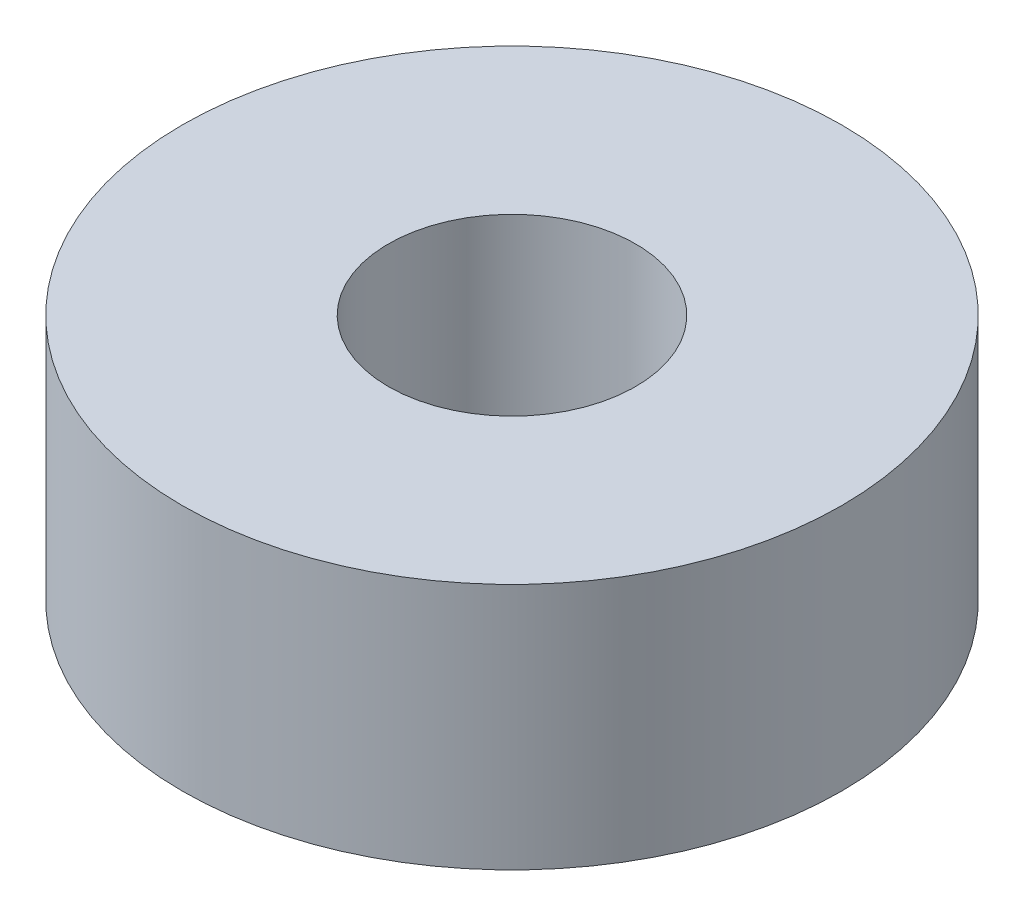
ISO-10303-21;
HEADER;
FILE_DESCRIPTION(('STEP AP214'),'2;1');
FILE_NAME('part.step','',(''),(''),'','','');
FILE_SCHEMA(('AUTOMOTIVE_DESIGN { 1 0 10303 214 1 1 1 1 }'));
ENDSEC;
DATA;
#1=APPLICATION_CONTEXT('core data for automotive mechanical design processes');
#2=APPLICATION_PROTOCOL_DEFINITION('international standard','automotive_design',2000,#1);
#3=PRODUCT_CONTEXT('',#1,'mechanical');
#4=PRODUCT('Part','Part','',(#3));
#5=PRODUCT_RELATED_PRODUCT_CATEGORY('part','',(#4));
#6=PRODUCT_DEFINITION_FORMATION('','',#4);
#7=PRODUCT_DEFINITION_CONTEXT('part definition',#1,'design');
#8=PRODUCT_DEFINITION('design','',#6,#7);
#9=PRODUCT_DEFINITION_SHAPE('','',#8);
#10=(LENGTH_UNIT() NAMED_UNIT(*) SI_UNIT(.MILLI.,.METRE.));
#11=(NAMED_UNIT(*) PLANE_ANGLE_UNIT() SI_UNIT($,.RADIAN.));
#12=(NAMED_UNIT(*) SI_UNIT($,.STERADIAN.) SOLID_ANGLE_UNIT());
#13=UNCERTAINTY_MEASURE_WITH_UNIT(LENGTH_MEASURE(1.E-05),#10,'distance_accuracy_value','');
#14=(GEOMETRIC_REPRESENTATION_CONTEXT(3) GLOBAL_UNCERTAINTY_ASSIGNED_CONTEXT((#13)) GLOBAL_UNIT_ASSIGNED_CONTEXT((#10,
#11,#12)) REPRESENTATION_CONTEXT('',''));
#15=CARTESIAN_POINT('',(0.,0.,0.));
#16=DIRECTION('',(0.,0.,1.));
#17=DIRECTION('',(1.,0.,0.));
#18=AXIS2_PLACEMENT_3D('',#15,#16,#17);
#19=CARTESIAN_POINT('',(0.,4.7625,0.));
#20=DIRECTION('',(0.,1.,0.));
#21=DIRECTION('',(0.,0.,1.));
#22=AXIS2_PLACEMENT_3D('',#19,#20,#21);
#23=PLANE('',#22);
#24=CARTESIAN_POINT('',(0.,4.7625,0.));
#25=DIRECTION('',(0.,1.,0.));
#26=DIRECTION('',(0.,0.,1.));
#27=AXIS2_PLACEMENT_3D('',#24,#25,#26);
#28=CIRCLE('',#27,12.7);
#29=CARTESIAN_POINT('',(0.,4.7625,12.7));
#30=VERTEX_POINT('',#29);
#31=EDGE_CURVE('E10',#30,#30,#28,.T.);
#32=ORIENTED_EDGE('',*,*,#31,.T.);
#33=EDGE_LOOP('',(#32));
#34=FACE_BOUND('',#33,.T.);
#35=CARTESIAN_POINT('',(0.,4.7625,0.));
#36=DIRECTION('',(0.,1.,0.));
#37=DIRECTION('',(0.,0.,1.));
#38=AXIS2_PLACEMENT_3D('',#35,#36,#37);
#39=CIRCLE('',#38,4.7625);
#40=CARTESIAN_POINT('',(0.,4.7625,4.7625));
#41=VERTEX_POINT('',#40);
#42=EDGE_CURVE('E42',#41,#41,#39,.T.);
#43=ORIENTED_EDGE('',*,*,#42,.F.);
#44=EDGE_LOOP('',(#43));
#45=FACE_BOUND('',#44,.T.);
#46=ADVANCED_FACE('F31',(#34,#45),#23,.T.);
#47=CARTESIAN_POINT('',(0.,-4.7625,0.));
#48=DIRECTION('',(0.,1.,0.));
#49=DIRECTION('',(0.,0.,1.));
#50=AXIS2_PLACEMENT_3D('',#47,#48,#49);
#51=PLANE('',#50);
#52=CARTESIAN_POINT('',(0.,-4.7625,0.));
#53=DIRECTION('',(0.,1.,0.));
#54=DIRECTION('',(0.,0.,1.));
#55=AXIS2_PLACEMENT_3D('',#52,#53,#54);
#56=CIRCLE('',#55,12.7);
#57=CARTESIAN_POINT('',(0.,-4.7625,12.7));
#58=VERTEX_POINT('',#57);
#59=EDGE_CURVE('E35',#58,#58,#56,.T.);
#60=ORIENTED_EDGE('',*,*,#59,.F.);
#61=EDGE_LOOP('',(#60));
#62=FACE_BOUND('',#61,.T.);
#63=CARTESIAN_POINT('',(0.,-4.7625,0.));
#64=DIRECTION('',(0.,1.,0.));
#65=DIRECTION('',(0.,0.,1.));
#66=AXIS2_PLACEMENT_3D('',#63,#64,#65);
#67=CIRCLE('',#66,4.7625);
#68=CARTESIAN_POINT('',(0.,-4.7625,4.7625));
#69=VERTEX_POINT('',#68);
#70=EDGE_CURVE('E44',#69,#69,#67,.T.);
#71=ORIENTED_EDGE('',*,*,#70,.T.);
#72=EDGE_LOOP('',(#71));
#73=FACE_BOUND('',#72,.T.);
#74=ADVANCED_FACE('F54',(#62,#73),#51,.F.);
#75=CARTESIAN_POINT('',(0.,4.7625,0.));
#76=DIRECTION('',(0.,-1.,0.));
#77=DIRECTION('',(0.,0.,-1.));
#78=AXIS2_PLACEMENT_3D('',#75,#76,#77);
#79=CYLINDRICAL_SURFACE('',#78,12.7);
#80=ORIENTED_EDGE('',*,*,#31,.F.);
#81=EDGE_LOOP('',(#80));
#82=FACE_BOUND('',#81,.T.);
#83=ORIENTED_EDGE('',*,*,#59,.T.);
#84=EDGE_LOOP('',(#83));
#85=FACE_BOUND('',#84,.T.);
#86=ADVANCED_FACE('F33',(#82,#85),#79,.T.);
#87=CARTESIAN_POINT('',(0.,4.7625,0.));
#88=DIRECTION('',(0.,-1.,0.));
#89=DIRECTION('',(0.,0.,-1.));
#90=AXIS2_PLACEMENT_3D('',#87,#88,#89);
#91=CYLINDRICAL_SURFACE('',#90,4.7625);
#92=ORIENTED_EDGE('',*,*,#42,.T.);
#93=EDGE_LOOP('',(#92));
#94=FACE_BOUND('',#93,.T.);
#95=ORIENTED_EDGE('',*,*,#70,.F.);
#96=EDGE_LOOP('',(#95));
#97=FACE_BOUND('',#96,.T.);
#98=ADVANCED_FACE('F50',(#94,#97),#91,.F.);
#99=CLOSED_SHELL('',(#46,#74,#86,#98));
#100=MANIFOLD_SOLID_BREP('B2',#99);
#101=ADVANCED_BREP_SHAPE_REPRESENTATION('',(#18,#100),#14);
#102=SHAPE_DEFINITION_REPRESENTATION(#9,#101);
ENDSEC;
END-ISO-10303-21;
